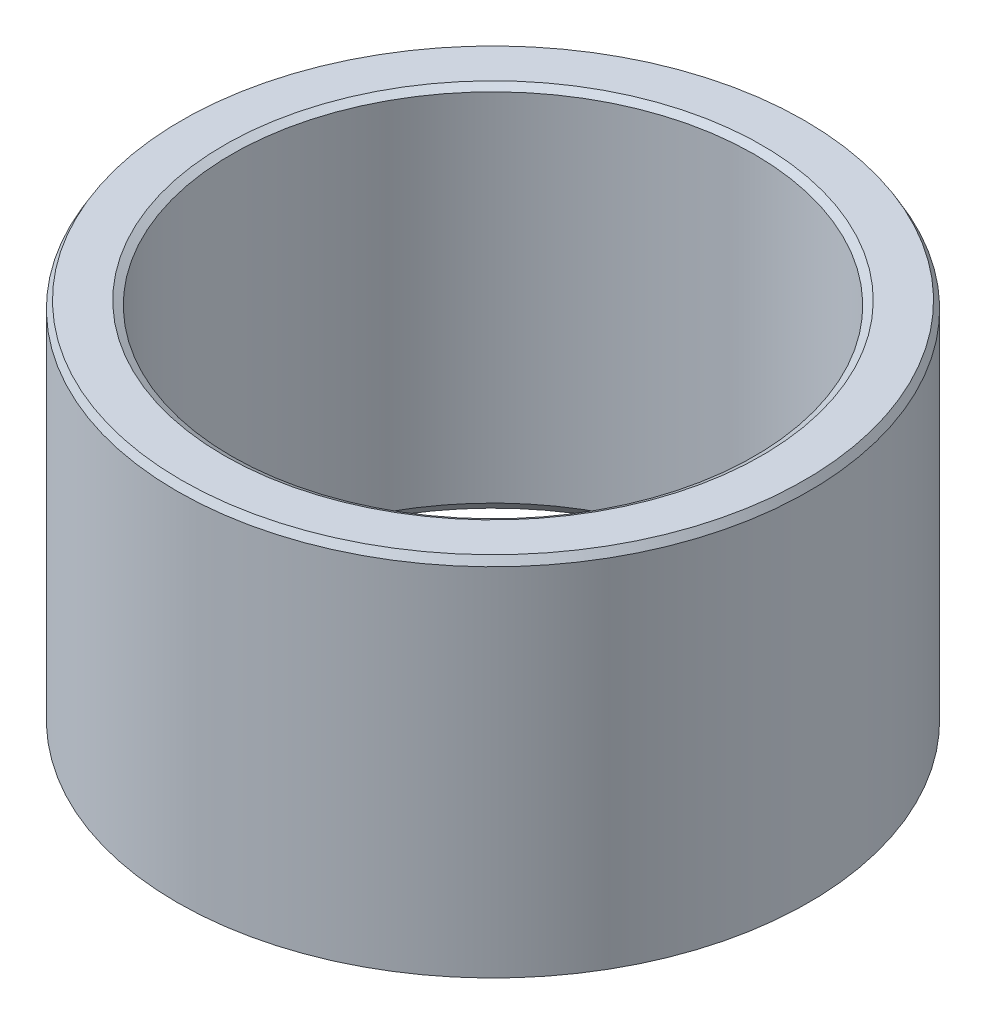
ISO-10303-21;
HEADER;
FILE_DESCRIPTION(('STEP AP214'),'2;1');
FILE_NAME('part.step','',(''),(''),'','','');
FILE_SCHEMA(('AUTOMOTIVE_DESIGN { 1 0 10303 214 1 1 1 1 }'));
ENDSEC;
DATA;
#1=APPLICATION_CONTEXT('core data for automotive mechanical design processes');
#2=APPLICATION_PROTOCOL_DEFINITION('international standard','automotive_design',2000,#1);
#3=PRODUCT_CONTEXT('',#1,'mechanical');
#4=PRODUCT('Part','Part','',(#3));
#5=PRODUCT_RELATED_PRODUCT_CATEGORY('part','',(#4));
#6=PRODUCT_DEFINITION_FORMATION('','',#4);
#7=PRODUCT_DEFINITION_CONTEXT('part definition',#1,'design');
#8=PRODUCT_DEFINITION('design','',#6,#7);
#9=PRODUCT_DEFINITION_SHAPE('','',#8);
#10=(LENGTH_UNIT() NAMED_UNIT(*) SI_UNIT(.MILLI.,.METRE.));
#11=(NAMED_UNIT(*) PLANE_ANGLE_UNIT() SI_UNIT($,.RADIAN.));
#12=(NAMED_UNIT(*) SI_UNIT($,.STERADIAN.) SOLID_ANGLE_UNIT());
#13=UNCERTAINTY_MEASURE_WITH_UNIT(LENGTH_MEASURE(1.E-05),#10,'distance_accuracy_value','');
#14=(GEOMETRIC_REPRESENTATION_CONTEXT(3) GLOBAL_UNCERTAINTY_ASSIGNED_CONTEXT((#13)) GLOBAL_UNIT_ASSIGNED_CONTEXT((#10,
#11,#12)) REPRESENTATION_CONTEXT('',''));
#15=CARTESIAN_POINT('',(0.,0.,0.));
#16=DIRECTION('',(0.,0.,1.));
#17=DIRECTION('',(1.,0.,0.));
#18=AXIS2_PLACEMENT_3D('',#15,#16,#17);
#19=CARTESIAN_POINT('',(0.,52.4144640587887,0.));
#20=DIRECTION('',(0.,-1.,0.));
#21=DIRECTION('',(0.,0.,-1.));
#22=AXIS2_PLACEMENT_3D('',#19,#20,#21);
#23=CYLINDRICAL_SURFACE('',#22,45.);
#24=CARTESIAN_POINT('',(0.,0.612338749712359,0.));
#25=DIRECTION('',(0.,1.,0.));
#26=DIRECTION('',(0.,0.,1.));
#27=AXIS2_PLACEMENT_3D('',#24,#25,#26);
#28=CIRCLE('',#27,45.);
#29=CARTESIAN_POINT('',(0.,0.612338749712359,45.));
#30=VERTEX_POINT('',#29);
#31=EDGE_CURVE('E10',#30,#30,#28,.T.);
#32=ORIENTED_EDGE('',*,*,#31,.T.);
#33=EDGE_LOOP('',(#32));
#34=FACE_BOUND('',#33,.T.);
#35=CARTESIAN_POINT('',(0.,51.3538622328437,0.));
#36=DIRECTION('',(0.,1.,0.));
#37=DIRECTION('',(0.,0.,1.));
#38=AXIS2_PLACEMENT_3D('',#35,#36,#37);
#39=CIRCLE('',#38,45.);
#40=CARTESIAN_POINT('',(0.,51.3538622328437,45.));
#41=VERTEX_POINT('',#40);
#42=EDGE_CURVE('E50',#41,#41,#39,.F.);
#43=ORIENTED_EDGE('',*,*,#42,.T.);
#44=EDGE_LOOP('',(#43));
#45=FACE_BOUND('',#44,.T.);
#46=ADVANCED_FACE('F39',(#34,#45),#23,.T.);
#47=CARTESIAN_POINT('',(0.,52.4144640587887,0.));
#48=DIRECTION('',(0.,1.,0.));
#49=DIRECTION('',(0.,0.,1.));
#50=AXIS2_PLACEMENT_3D('',#47,#48,#49);
#51=PLANE('',#50);
#52=CARTESIAN_POINT('',(0.,52.4144640587887,0.));
#53=DIRECTION('',(0.,1.,0.));
#54=DIRECTION('',(0.,0.,1.));
#55=AXIS2_PLACEMENT_3D('',#52,#53,#54);
#56=CIRCLE('',#55,38.3108567128277);
#57=CARTESIAN_POINT('',(0.,52.4144640587887,38.3108567128277));
#58=VERTEX_POINT('',#57);
#59=EDGE_CURVE('E58',#58,#58,#56,.F.);
#60=ORIENTED_EDGE('',*,*,#59,.T.);
#61=EDGE_LOOP('',(#60));
#62=FACE_BOUND('',#61,.T.);
#63=CARTESIAN_POINT('',(0.,52.4144640587887,0.));
#64=DIRECTION('',(0.,1.,0.));
#65=DIRECTION('',(0.,0.,1.));
#66=AXIS2_PLACEMENT_3D('',#63,#64,#65);
#67=CIRCLE('',#66,44.3876612502877);
#68=CARTESIAN_POINT('',(0.,52.4144640587887,44.3876612502877));
#69=VERTEX_POINT('',#68);
#70=EDGE_CURVE('E61',#69,#69,#67,.T.);
#71=ORIENTED_EDGE('',*,*,#70,.T.);
#72=EDGE_LOOP('',(#71));
#73=FACE_BOUND('',#72,.T.);
#74=ADVANCED_FACE('F88',(#62,#73),#51,.T.);
#75=CARTESIAN_POINT('',(0.,0.,0.));
#76=DIRECTION('',(0.,1.,0.));
#77=DIRECTION('',(0.,0.,1.));
#78=AXIS2_PLACEMENT_3D('',#75,#76,#77);
#79=PLANE('',#78);
#80=CARTESIAN_POINT('',(0.,0.,0.));
#81=DIRECTION('',(0.,1.,0.));
#82=DIRECTION('',(0.,0.,1.));
#83=AXIS2_PLACEMENT_3D('',#80,#81,#82);
#84=CIRCLE('',#83,37.862593636595);
#85=CARTESIAN_POINT('',(0.,0.,37.862593636595));
#86=VERTEX_POINT('',#85);
#87=EDGE_CURVE('E51',#86,#86,#84,.T.);
#88=ORIENTED_EDGE('',*,*,#87,.T.);
#89=EDGE_LOOP('',(#88));
#90=FACE_BOUND('',#89,.T.);
#91=CARTESIAN_POINT('',(0.,0.,0.));
#92=DIRECTION('',(0.,1.,0.));
#93=DIRECTION('',(0.,0.,1.));
#94=AXIS2_PLACEMENT_3D('',#91,#92,#93);
#95=CIRCLE('',#94,43.939398174055);
#96=CARTESIAN_POINT('',(0.,0.,43.939398174055));
#97=VERTEX_POINT('',#96);
#98=EDGE_CURVE('E54',#97,#97,#95,.F.);
#99=ORIENTED_EDGE('',*,*,#98,.T.);
#100=EDGE_LOOP('',(#99));
#101=FACE_BOUND('',#100,.T.);
#102=ADVANCED_FACE('F83',(#90,#101),#79,.F.);
#103=CARTESIAN_POINT('',(0.,52.4144640587887,0.));
#104=DIRECTION('',(0.,-1.,0.));
#105=DIRECTION('',(0.,0.,-1.));
#106=AXIS2_PLACEMENT_3D('',#103,#104,#105);
#107=CYLINDRICAL_SURFACE('',#106,37.2502548868827);
#108=CARTESIAN_POINT('',(0.,51.8021253090764,0.));
#109=DIRECTION('',(0.,1.,0.));
#110=DIRECTION('',(0.,0.,1.));
#111=AXIS2_PLACEMENT_3D('',#108,#109,#110);
#112=CIRCLE('',#111,37.2502548868827);
#113=CARTESIAN_POINT('',(0.,51.8021253090764,37.2502548868827));
#114=VERTEX_POINT('',#113);
#115=EDGE_CURVE('E67',#114,#114,#112,.T.);
#116=ORIENTED_EDGE('',*,*,#115,.T.);
#117=EDGE_LOOP('',(#116));
#118=FACE_BOUND('',#117,.T.);
#119=CARTESIAN_POINT('',(0.,1.06060182594504,0.));
#120=DIRECTION('',(0.,1.,0.));
#121=DIRECTION('',(0.,0.,1.));
#122=AXIS2_PLACEMENT_3D('',#119,#120,#121);
#123=CIRCLE('',#122,37.2502548868827);
#124=CARTESIAN_POINT('',(0.,1.06060182594504,37.2502548868827));
#125=VERTEX_POINT('',#124);
#126=EDGE_CURVE('E69',#125,#125,#123,.F.);
#127=ORIENTED_EDGE('',*,*,#126,.T.);
#128=EDGE_LOOP('',(#127));
#129=FACE_BOUND('',#128,.T.);
#130=ADVANCED_FACE('F71',(#118,#129),#107,.F.);
#131=CARTESIAN_POINT('',(0.,51.8021253090764,0.));
#132=DIRECTION('',(0.,1.,0.));
#133=DIRECTION('',(0.,0.,1.));
#134=AXIS2_PLACEMENT_3D('',#131,#132,#133);
#135=CONICAL_SURFACE('',#134,37.2502548868827,1.04719755119661);
#136=ORIENTED_EDGE('',*,*,#59,.F.);
#137=EDGE_LOOP('',(#136));
#138=FACE_BOUND('',#137,.T.);
#139=ORIENTED_EDGE('',*,*,#115,.F.);
#140=EDGE_LOOP('',(#139));
#141=FACE_BOUND('',#140,.T.);
#142=ADVANCED_FACE('F77',(#138,#141),#135,.F.);
#143=CARTESIAN_POINT('',(0.,0.,0.));
#144=DIRECTION('',(0.,-1.,0.));
#145=DIRECTION('',(0.,0.,-1.));
#146=AXIS2_PLACEMENT_3D('',#143,#144,#145);
#147=CONICAL_SURFACE('',#146,37.862593636595,0.523598775598289);
#148=ORIENTED_EDGE('',*,*,#126,.F.);
#149=EDGE_LOOP('',(#148));
#150=FACE_BOUND('',#149,.T.);
#151=ORIENTED_EDGE('',*,*,#87,.F.);
#152=EDGE_LOOP('',(#151));
#153=FACE_BOUND('',#152,.T.);
#154=ADVANCED_FACE('F73',(#150,#153),#147,.F.);
#155=CARTESIAN_POINT('',(0.,0.612338749712359,0.));
#156=DIRECTION('',(0.,1.,0.));
#157=DIRECTION('',(0.,0.,1.));
#158=AXIS2_PLACEMENT_3D('',#155,#156,#157);
#159=CONICAL_SURFACE('',#158,45.,1.0471975511966);
#160=ORIENTED_EDGE('',*,*,#98,.F.);
#161=EDGE_LOOP('',(#160));
#162=FACE_BOUND('',#161,.T.);
#163=ORIENTED_EDGE('',*,*,#31,.F.);
#164=EDGE_LOOP('',(#163));
#165=FACE_BOUND('',#164,.T.);
#166=ADVANCED_FACE('F76',(#162,#165),#159,.T.);
#167=CARTESIAN_POINT('',(0.,52.4144640587887,0.));
#168=DIRECTION('',(0.,-1.,0.));
#169=DIRECTION('',(0.,0.,-1.));
#170=AXIS2_PLACEMENT_3D('',#167,#168,#169);
#171=CONICAL_SURFACE('',#170,44.3876612502877,0.523598775598283);
#172=ORIENTED_EDGE('',*,*,#42,.F.);
#173=EDGE_LOOP('',(#172));
#174=FACE_BOUND('',#173,.T.);
#175=ORIENTED_EDGE('',*,*,#70,.F.);
#176=EDGE_LOOP('',(#175));
#177=FACE_BOUND('',#176,.T.);
#178=ADVANCED_FACE('F45',(#174,#177),#171,.T.);
#179=CLOSED_SHELL('',(#46,#74,#102,#130,#142,#154,#166,#178));
#180=MANIFOLD_SOLID_BREP('B2',#179);
#181=ADVANCED_BREP_SHAPE_REPRESENTATION('',(#18,#180),#14);
#182=SHAPE_DEFINITION_REPRESENTATION(#9,#181);
ENDSEC;
END-ISO-10303-21;
